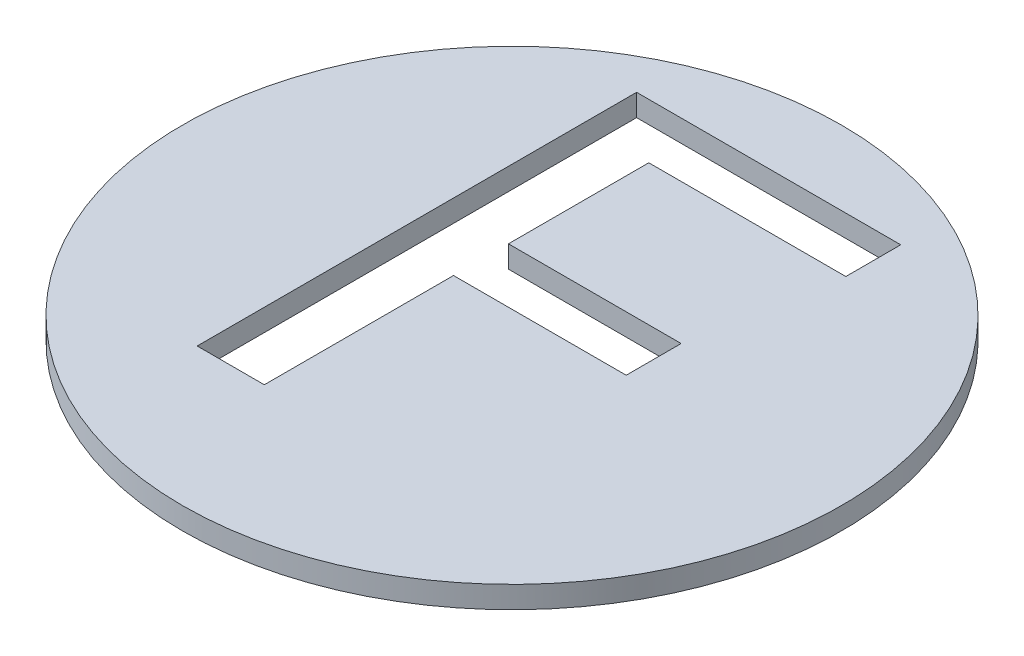
ISO-10303-21;
HEADER;
FILE_DESCRIPTION(('STEP AP214'),'2;1');
FILE_NAME('part.step','',(''),(''),'','','');
FILE_SCHEMA(('AUTOMOTIVE_DESIGN { 1 0 10303 214 1 1 1 1 }'));
ENDSEC;
DATA;
#1=APPLICATION_CONTEXT('core data for automotive mechanical design processes');
#2=APPLICATION_PROTOCOL_DEFINITION('international standard','automotive_design',2000,#1);
#3=PRODUCT_CONTEXT('',#1,'mechanical');
#4=PRODUCT('Part','Part','',(#3));
#5=PRODUCT_RELATED_PRODUCT_CATEGORY('part','',(#4));
#6=PRODUCT_DEFINITION_FORMATION('','',#4);
#7=PRODUCT_DEFINITION_CONTEXT('part definition',#1,'design');
#8=PRODUCT_DEFINITION('design','',#6,#7);
#9=PRODUCT_DEFINITION_SHAPE('','',#8);
#10=(LENGTH_UNIT() NAMED_UNIT(*) SI_UNIT(.MILLI.,.METRE.));
#11=(NAMED_UNIT(*) PLANE_ANGLE_UNIT() SI_UNIT($,.RADIAN.));
#12=(NAMED_UNIT(*) SI_UNIT($,.STERADIAN.) SOLID_ANGLE_UNIT());
#13=UNCERTAINTY_MEASURE_WITH_UNIT(LENGTH_MEASURE(1.E-05),#10,'distance_accuracy_value','');
#14=(GEOMETRIC_REPRESENTATION_CONTEXT(3) GLOBAL_UNCERTAINTY_ASSIGNED_CONTEXT((#13)) GLOBAL_UNIT_ASSIGNED_CONTEXT((#10,
#11,#12)) REPRESENTATION_CONTEXT('',''));
#15=CARTESIAN_POINT('',(0.,0.,0.));
#16=DIRECTION('',(0.,0.,1.));
#17=DIRECTION('',(1.,0.,0.));
#18=AXIS2_PLACEMENT_3D('',#15,#16,#17);
#19=CARTESIAN_POINT('',(0.,3.,0.));
#20=DIRECTION('',(0.,-1.,0.));
#21=DIRECTION('',(0.,0.,-1.));
#22=AXIS2_PLACEMENT_3D('',#19,#20,#21);
#23=CYLINDRICAL_SURFACE('',#22,45.);
#24=CARTESIAN_POINT('',(0.,3.,0.));
#25=DIRECTION('',(0.,1.,0.));
#26=DIRECTION('',(0.,0.,1.));
#27=AXIS2_PLACEMENT_3D('',#24,#25,#26);
#28=CIRCLE('',#27,45.);
#29=CARTESIAN_POINT('',(0.,3.,45.));
#30=VERTEX_POINT('',#29);
#31=EDGE_CURVE('E11',#30,#30,#28,.T.);
#32=ORIENTED_EDGE('',*,*,#31,.F.);
#33=EDGE_LOOP('',(#32));
#34=FACE_BOUND('',#33,.T.);
#35=CARTESIAN_POINT('',(0.,0.,0.));
#36=DIRECTION('',(0.,1.,0.));
#37=DIRECTION('',(0.,0.,1.));
#38=AXIS2_PLACEMENT_3D('',#35,#36,#37);
#39=CIRCLE('',#38,45.);
#40=CARTESIAN_POINT('',(0.,0.,45.));
#41=VERTEX_POINT('',#40);
#42=EDGE_CURVE('E36',#41,#41,#39,.T.);
#43=ORIENTED_EDGE('',*,*,#42,.T.);
#44=EDGE_LOOP('',(#43));
#45=FACE_BOUND('',#44,.T.);
#46=ADVANCED_FACE('F33',(#34,#45),#23,.T.);
#47=CARTESIAN_POINT('',(0.,3.,0.));
#48=DIRECTION('',(0.,1.,0.));
#49=DIRECTION('',(0.,0.,1.));
#50=AXIS2_PLACEMENT_3D('',#47,#48,#49);
#51=PLANE('',#50);
#52=DIRECTION('',(1.,0.,0.));
#53=VECTOR('',#52,1.);
#54=CARTESIAN_POINT('',(-17.8661139991804,3.,-34.8798677033783));
#55=LINE('',#54,#53);
#56=CARTESIAN_POINT('',(-17.8661139991804,3.,-34.8798677033783));
#57=VERTEX_POINT('',#56);
#58=CARTESIAN_POINT('',(18.2015943341529,3.,-34.8798677033783));
#59=VERTEX_POINT('',#58);
#60=EDGE_CURVE('E111',#57,#59,#55,.T.);
#61=ORIENTED_EDGE('',*,*,#60,.T.);
#62=DIRECTION('',(0.,0.,1.));
#63=VECTOR('',#62,1.);
#64=CARTESIAN_POINT('',(18.2015943341529,3.,-34.8798677033783));
#65=LINE('',#64,#63);
#66=CARTESIAN_POINT('',(18.2015943341529,3.,-27.3798677033783));
#67=VERTEX_POINT('',#66);
#68=EDGE_CURVE('E120',#59,#67,#65,.T.);
#69=ORIENTED_EDGE('',*,*,#68,.T.);
#70=DIRECTION('',(-1.,0.,0.));
#71=VECTOR('',#70,1.);
#72=CARTESIAN_POINT('',(18.2015943341529,3.,-27.3798677033783));
#73=LINE('',#72,#71);
#74=CARTESIAN_POINT('',(-8.69944733251376,3.,-27.3798677033783));
#75=VERTEX_POINT('',#74);
#76=EDGE_CURVE('E47',#67,#75,#73,.T.);
#77=ORIENTED_EDGE('',*,*,#76,.T.);
#78=DIRECTION('',(0.,0.,1.));
#79=VECTOR('',#78,1.);
#80=CARTESIAN_POINT('',(-8.69944733251376,3.,-27.3798677033783));
#81=LINE('',#80,#79);
#82=CARTESIAN_POINT('',(-8.69944733251376,3.,-8.21320103671168));
#83=VERTEX_POINT('',#82);
#84=EDGE_CURVE('E135',#75,#83,#81,.T.);
#85=ORIENTED_EDGE('',*,*,#84,.T.);
#86=DIRECTION('',(1.,0.,0.));
#87=VECTOR('',#86,1.);
#88=CARTESIAN_POINT('',(-8.69944733251376,3.,-8.21320103671168));
#89=LINE('',#88,#87);
#90=CARTESIAN_POINT('',(14.8812818341529,3.,-8.21320103671168));
#91=VERTEX_POINT('',#90);
#92=EDGE_CURVE('E138',#83,#91,#89,.T.);
#93=ORIENTED_EDGE('',*,*,#92,.T.);
#94=DIRECTION('',(0.,0.,1.));
#95=VECTOR('',#94,1.);
#96=CARTESIAN_POINT('',(14.8812818341529,3.,-8.21320103671168));
#97=LINE('',#96,#95);
#98=CARTESIAN_POINT('',(14.8812818341529,3.,-0.713201036711679));
#99=VERTEX_POINT('',#98);
#100=EDGE_CURVE('E141',#91,#99,#97,.T.);
#101=ORIENTED_EDGE('',*,*,#100,.T.);
#102=DIRECTION('',(-1.,0.,0.));
#103=VECTOR('',#102,1.);
#104=CARTESIAN_POINT('',(14.8812818341529,3.,-0.713201036711679));
#105=LINE('',#104,#103);
#106=CARTESIAN_POINT('',(-8.69944733251376,3.,-0.713201036711679));
#107=VERTEX_POINT('',#106);
#108=EDGE_CURVE('E144',#99,#107,#105,.T.);
#109=ORIENTED_EDGE('',*,*,#108,.T.);
#110=DIRECTION('',(0.,0.,1.));
#111=VECTOR('',#110,1.);
#112=CARTESIAN_POINT('',(-8.69944733251376,3.,-0.713201036711679));
#113=LINE('',#112,#111);
#114=CARTESIAN_POINT('',(-8.69944733251376,3.,25.1201322966217));
#115=VERTEX_POINT('',#114);
#116=EDGE_CURVE('E147',#107,#115,#113,.T.);
#117=ORIENTED_EDGE('',*,*,#116,.T.);
#118=DIRECTION('',(-1.,0.,0.));
#119=VECTOR('',#118,1.);
#120=CARTESIAN_POINT('',(-8.69944733251376,3.,25.1201322966217));
#121=LINE('',#120,#119);
#122=CARTESIAN_POINT('',(-17.8661139991804,3.,25.1201322966217));
#123=VERTEX_POINT('',#122);
#124=EDGE_CURVE('E150',#115,#123,#121,.T.);
#125=ORIENTED_EDGE('',*,*,#124,.T.);
#126=DIRECTION('',(0.,0.,-1.));
#127=VECTOR('',#126,1.);
#128=CARTESIAN_POINT('',(-17.8661139991804,3.,25.1201322966217));
#129=LINE('',#128,#127);
#130=EDGE_CURVE('E117',#123,#57,#129,.T.);
#131=ORIENTED_EDGE('',*,*,#130,.T.);
#132=EDGE_LOOP('',(#61,#69,#77,#85,#93,#101,#109,#117,#125,#131));
#133=FACE_BOUND('',#132,.T.);
#134=ORIENTED_EDGE('',*,*,#31,.T.);
#135=EDGE_LOOP('',(#134));
#136=FACE_BOUND('',#135,.T.);
#137=ADVANCED_FACE('F124',(#133,#136),#51,.T.);
#138=CARTESIAN_POINT('',(0.,0.,0.));
#139=DIRECTION('',(0.,1.,0.));
#140=DIRECTION('',(0.,0.,1.));
#141=AXIS2_PLACEMENT_3D('',#138,#139,#140);
#142=PLANE('',#141);
#143=DIRECTION('',(0.,0.,1.));
#144=VECTOR('',#143,1.);
#145=CARTESIAN_POINT('',(18.2015943341529,0.,-34.8798677033783));
#146=LINE('',#145,#144);
#147=CARTESIAN_POINT('',(18.2015943341529,0.,-34.8798677033783));
#148=VERTEX_POINT('',#147);
#149=CARTESIAN_POINT('',(18.2015943341529,0.,-27.3798677033783));
#150=VERTEX_POINT('',#149);
#151=EDGE_CURVE('E154',#148,#150,#146,.T.);
#152=ORIENTED_EDGE('',*,*,#151,.F.);
#153=DIRECTION('',(1.,0.,0.));
#154=VECTOR('',#153,1.);
#155=CARTESIAN_POINT('',(-17.8661139991804,0.,-34.8798677033783));
#156=LINE('',#155,#154);
#157=CARTESIAN_POINT('',(-17.8661139991804,0.,-34.8798677033783));
#158=VERTEX_POINT('',#157);
#159=EDGE_CURVE('E55',#158,#148,#156,.T.);
#160=ORIENTED_EDGE('',*,*,#159,.F.);
#161=DIRECTION('',(0.,0.,-1.));
#162=VECTOR('',#161,1.);
#163=CARTESIAN_POINT('',(-17.8661139991804,0.,25.1201322966217));
#164=LINE('',#163,#162);
#165=CARTESIAN_POINT('',(-17.8661139991804,0.,25.1201322966217));
#166=VERTEX_POINT('',#165);
#167=EDGE_CURVE('E128',#166,#158,#164,.T.);
#168=ORIENTED_EDGE('',*,*,#167,.F.);
#169=DIRECTION('',(-1.,0.,0.));
#170=VECTOR('',#169,1.);
#171=CARTESIAN_POINT('',(-8.69944733251376,0.,25.1201322966217));
#172=LINE('',#171,#170);
#173=CARTESIAN_POINT('',(-8.69944733251376,0.,25.1201322966217));
#174=VERTEX_POINT('',#173);
#175=EDGE_CURVE('E131',#174,#166,#172,.T.);
#176=ORIENTED_EDGE('',*,*,#175,.F.);
#177=DIRECTION('',(0.,0.,1.));
#178=VECTOR('',#177,1.);
#179=CARTESIAN_POINT('',(-8.69944733251376,0.,-0.713201036711679));
#180=LINE('',#179,#178);
#181=CARTESIAN_POINT('',(-8.69944733251376,0.,-0.713201036711679));
#182=VERTEX_POINT('',#181);
#183=EDGE_CURVE('E171',#182,#174,#180,.T.);
#184=ORIENTED_EDGE('',*,*,#183,.F.);
#185=DIRECTION('',(-1.,0.,0.));
#186=VECTOR('',#185,1.);
#187=CARTESIAN_POINT('',(14.8812818341529,0.,-0.713201036711679));
#188=LINE('',#187,#186);
#189=CARTESIAN_POINT('',(14.8812818341529,0.,-0.713201036711679));
#190=VERTEX_POINT('',#189);
#191=EDGE_CURVE('E168',#190,#182,#188,.T.);
#192=ORIENTED_EDGE('',*,*,#191,.F.);
#193=DIRECTION('',(0.,0.,1.));
#194=VECTOR('',#193,1.);
#195=CARTESIAN_POINT('',(14.8812818341529,0.,-8.21320103671168));
#196=LINE('',#195,#194);
#197=CARTESIAN_POINT('',(14.8812818341529,0.,-8.21320103671168));
#198=VERTEX_POINT('',#197);
#199=EDGE_CURVE('E165',#198,#190,#196,.T.);
#200=ORIENTED_EDGE('',*,*,#199,.F.);
#201=DIRECTION('',(1.,0.,0.));
#202=VECTOR('',#201,1.);
#203=CARTESIAN_POINT('',(-8.69944733251376,0.,-8.21320103671168));
#204=LINE('',#203,#202);
#205=CARTESIAN_POINT('',(-8.69944733251376,0.,-8.21320103671168));
#206=VERTEX_POINT('',#205);
#207=EDGE_CURVE('E162',#206,#198,#204,.T.);
#208=ORIENTED_EDGE('',*,*,#207,.F.);
#209=DIRECTION('',(0.,0.,1.));
#210=VECTOR('',#209,1.);
#211=CARTESIAN_POINT('',(-8.69944733251376,0.,-27.3798677033783));
#212=LINE('',#211,#210);
#213=CARTESIAN_POINT('',(-8.69944733251376,0.,-27.3798677033783));
#214=VERTEX_POINT('',#213);
#215=EDGE_CURVE('E159',#214,#206,#212,.T.);
#216=ORIENTED_EDGE('',*,*,#215,.F.);
#217=DIRECTION('',(-1.,0.,0.));
#218=VECTOR('',#217,1.);
#219=CARTESIAN_POINT('',(18.2015943341529,0.,-27.3798677033783));
#220=LINE('',#219,#218);
#221=EDGE_CURVE('E156',#150,#214,#220,.T.);
#222=ORIENTED_EDGE('',*,*,#221,.F.);
#223=EDGE_LOOP('',(#152,#160,#168,#176,#184,#192,#200,#208,#216,#222));
#224=FACE_BOUND('',#223,.T.);
#225=ORIENTED_EDGE('',*,*,#42,.F.);
#226=EDGE_LOOP('',(#225));
#227=FACE_BOUND('',#226,.T.);
#228=ADVANCED_FACE('F196',(#224,#227),#142,.F.);
#229=CARTESIAN_POINT('',(-17.8661139991804,3.,-34.8798677033783));
#230=DIRECTION('',(0.,0.,-1.));
#231=DIRECTION('',(-1.,0.,0.));
#232=AXIS2_PLACEMENT_3D('',#229,#230,#231);
#233=PLANE('',#232);
#234=ORIENTED_EDGE('',*,*,#159,.T.);
#235=DIRECTION('',(0.,-1.,0.));
#236=VECTOR('',#235,1.);
#237=CARTESIAN_POINT('',(18.2015943341529,3.,-34.8798677033783));
#238=LINE('',#237,#236);
#239=EDGE_CURVE('E107',#59,#148,#238,.T.);
#240=ORIENTED_EDGE('',*,*,#239,.F.);
#241=ORIENTED_EDGE('',*,*,#60,.F.);
#242=DIRECTION('',(0.,-1.,0.));
#243=VECTOR('',#242,1.);
#244=CARTESIAN_POINT('',(-17.8661139991804,3.,-34.8798677033783));
#245=LINE('',#244,#243);
#246=EDGE_CURVE('E176',#57,#158,#245,.T.);
#247=ORIENTED_EDGE('',*,*,#246,.T.);
#248=EDGE_LOOP('',(#234,#240,#241,#247));
#249=FACE_BOUND('',#248,.T.);
#250=ADVANCED_FACE('F109',(#249),#233,.F.);
#251=CARTESIAN_POINT('',(-17.8661139991804,3.,25.1201322966217));
#252=DIRECTION('',(-1.,0.,0.));
#253=DIRECTION('',(0.,0.,1.));
#254=AXIS2_PLACEMENT_3D('',#251,#252,#253);
#255=PLANE('',#254);
#256=ORIENTED_EDGE('',*,*,#167,.T.);
#257=ORIENTED_EDGE('',*,*,#246,.F.);
#258=ORIENTED_EDGE('',*,*,#130,.F.);
#259=DIRECTION('',(0.,-1.,0.));
#260=VECTOR('',#259,1.);
#261=CARTESIAN_POINT('',(-17.8661139991804,3.,25.1201322966217));
#262=LINE('',#261,#260);
#263=EDGE_CURVE('E178',#123,#166,#262,.T.);
#264=ORIENTED_EDGE('',*,*,#263,.T.);
#265=EDGE_LOOP('',(#256,#257,#258,#264));
#266=FACE_BOUND('',#265,.T.);
#267=ADVANCED_FACE('F223',(#266),#255,.F.);
#268=CARTESIAN_POINT('',(-8.69944733251376,3.,25.1201322966217));
#269=DIRECTION('',(0.,0.,1.));
#270=DIRECTION('',(1.,0.,0.));
#271=AXIS2_PLACEMENT_3D('',#268,#269,#270);
#272=PLANE('',#271);
#273=ORIENTED_EDGE('',*,*,#175,.T.);
#274=ORIENTED_EDGE('',*,*,#263,.F.);
#275=ORIENTED_EDGE('',*,*,#124,.F.);
#276=DIRECTION('',(0.,-1.,0.));
#277=VECTOR('',#276,1.);
#278=CARTESIAN_POINT('',(-8.69944733251376,3.,25.1201322966217));
#279=LINE('',#278,#277);
#280=EDGE_CURVE('E180',#115,#174,#279,.T.);
#281=ORIENTED_EDGE('',*,*,#280,.T.);
#282=EDGE_LOOP('',(#273,#274,#275,#281));
#283=FACE_BOUND('',#282,.T.);
#284=ADVANCED_FACE('F220',(#283),#272,.F.);
#285=CARTESIAN_POINT('',(-8.69944733251376,3.,-0.713201036711679));
#286=DIRECTION('',(1.,0.,0.));
#287=DIRECTION('',(0.,0.,-1.));
#288=AXIS2_PLACEMENT_3D('',#285,#286,#287);
#289=PLANE('',#288);
#290=ORIENTED_EDGE('',*,*,#183,.T.);
#291=ORIENTED_EDGE('',*,*,#280,.F.);
#292=ORIENTED_EDGE('',*,*,#116,.F.);
#293=DIRECTION('',(0.,-1.,0.));
#294=VECTOR('',#293,1.);
#295=CARTESIAN_POINT('',(-8.69944733251376,3.,-0.713201036711679));
#296=LINE('',#295,#294);
#297=EDGE_CURVE('E182',#107,#182,#296,.T.);
#298=ORIENTED_EDGE('',*,*,#297,.T.);
#299=EDGE_LOOP('',(#290,#291,#292,#298));
#300=FACE_BOUND('',#299,.T.);
#301=ADVANCED_FACE('F216',(#300),#289,.F.);
#302=CARTESIAN_POINT('',(14.8812818341529,3.,-0.713201036711679));
#303=DIRECTION('',(0.,0.,1.));
#304=DIRECTION('',(1.,0.,0.));
#305=AXIS2_PLACEMENT_3D('',#302,#303,#304);
#306=PLANE('',#305);
#307=ORIENTED_EDGE('',*,*,#191,.T.);
#308=ORIENTED_EDGE('',*,*,#297,.F.);
#309=ORIENTED_EDGE('',*,*,#108,.F.);
#310=DIRECTION('',(0.,-1.,0.));
#311=VECTOR('',#310,1.);
#312=CARTESIAN_POINT('',(14.8812818341529,3.,-0.713201036711679));
#313=LINE('',#312,#311);
#314=EDGE_CURVE('E184',#99,#190,#313,.T.);
#315=ORIENTED_EDGE('',*,*,#314,.T.);
#316=EDGE_LOOP('',(#307,#308,#309,#315));
#317=FACE_BOUND('',#316,.T.);
#318=ADVANCED_FACE('F212',(#317),#306,.F.);
#319=CARTESIAN_POINT('',(14.8812818341529,3.,-8.21320103671168));
#320=DIRECTION('',(1.,0.,0.));
#321=DIRECTION('',(0.,0.,-1.));
#322=AXIS2_PLACEMENT_3D('',#319,#320,#321);
#323=PLANE('',#322);
#324=ORIENTED_EDGE('',*,*,#199,.T.);
#325=ORIENTED_EDGE('',*,*,#314,.F.);
#326=ORIENTED_EDGE('',*,*,#100,.F.);
#327=DIRECTION('',(0.,-1.,0.));
#328=VECTOR('',#327,1.);
#329=CARTESIAN_POINT('',(14.8812818341529,3.,-8.21320103671168));
#330=LINE('',#329,#328);
#331=EDGE_CURVE('E186',#91,#198,#330,.T.);
#332=ORIENTED_EDGE('',*,*,#331,.T.);
#333=EDGE_LOOP('',(#324,#325,#326,#332));
#334=FACE_BOUND('',#333,.T.);
#335=ADVANCED_FACE('F208',(#334),#323,.F.);
#336=CARTESIAN_POINT('',(-8.69944733251376,3.,-8.21320103671168));
#337=DIRECTION('',(0.,0.,-1.));
#338=DIRECTION('',(-1.,0.,0.));
#339=AXIS2_PLACEMENT_3D('',#336,#337,#338);
#340=PLANE('',#339);
#341=ORIENTED_EDGE('',*,*,#207,.T.);
#342=ORIENTED_EDGE('',*,*,#331,.F.);
#343=ORIENTED_EDGE('',*,*,#92,.F.);
#344=DIRECTION('',(0.,-1.,0.));
#345=VECTOR('',#344,1.);
#346=CARTESIAN_POINT('',(-8.69944733251376,3.,-8.21320103671168));
#347=LINE('',#346,#345);
#348=EDGE_CURVE('E188',#83,#206,#347,.T.);
#349=ORIENTED_EDGE('',*,*,#348,.T.);
#350=EDGE_LOOP('',(#341,#342,#343,#349));
#351=FACE_BOUND('',#350,.T.);
#352=ADVANCED_FACE('F206',(#351),#340,.F.);
#353=CARTESIAN_POINT('',(-8.69944733251376,3.,-27.3798677033783));
#354=DIRECTION('',(1.,0.,0.));
#355=DIRECTION('',(0.,0.,-1.));
#356=AXIS2_PLACEMENT_3D('',#353,#354,#355);
#357=PLANE('',#356);
#358=ORIENTED_EDGE('',*,*,#215,.T.);
#359=ORIENTED_EDGE('',*,*,#348,.F.);
#360=ORIENTED_EDGE('',*,*,#84,.F.);
#361=DIRECTION('',(0.,-1.,0.));
#362=VECTOR('',#361,1.);
#363=CARTESIAN_POINT('',(-8.69944733251376,3.,-27.3798677033783));
#364=LINE('',#363,#362);
#365=EDGE_CURVE('E190',#75,#214,#364,.T.);
#366=ORIENTED_EDGE('',*,*,#365,.T.);
#367=EDGE_LOOP('',(#358,#359,#360,#366));
#368=FACE_BOUND('',#367,.T.);
#369=ADVANCED_FACE('F201',(#368),#357,.F.);
#370=CARTESIAN_POINT('',(18.2015943341529,3.,-27.3798677033783));
#371=DIRECTION('',(0.,0.,1.));
#372=DIRECTION('',(1.,0.,0.));
#373=AXIS2_PLACEMENT_3D('',#370,#371,#372);
#374=PLANE('',#373);
#375=ORIENTED_EDGE('',*,*,#221,.T.);
#376=ORIENTED_EDGE('',*,*,#365,.F.);
#377=ORIENTED_EDGE('',*,*,#76,.F.);
#378=DIRECTION('',(0.,-1.,0.));
#379=VECTOR('',#378,1.);
#380=CARTESIAN_POINT('',(18.2015943341529,3.,-27.3798677033783));
#381=LINE('',#380,#379);
#382=EDGE_CURVE('E116',#67,#150,#381,.T.);
#383=ORIENTED_EDGE('',*,*,#382,.T.);
#384=EDGE_LOOP('',(#375,#376,#377,#383));
#385=FACE_BOUND('',#384,.T.);
#386=ADVANCED_FACE('F192',(#385),#374,.F.);
#387=CARTESIAN_POINT('',(18.2015943341529,3.,-34.8798677033783));
#388=DIRECTION('',(1.,0.,0.));
#389=DIRECTION('',(0.,0.,-1.));
#390=AXIS2_PLACEMENT_3D('',#387,#388,#389);
#391=PLANE('',#390);
#392=ORIENTED_EDGE('',*,*,#151,.T.);
#393=ORIENTED_EDGE('',*,*,#382,.F.);
#394=ORIENTED_EDGE('',*,*,#68,.F.);
#395=ORIENTED_EDGE('',*,*,#239,.T.);
#396=EDGE_LOOP('',(#392,#393,#394,#395));
#397=FACE_BOUND('',#396,.T.);
#398=ADVANCED_FACE('F121',(#397),#391,.F.);
#399=CLOSED_SHELL('',(#46,#137,#228,#250,#267,#284,#301,#318,#335,#352,#369,#386,#398));
#400=MANIFOLD_SOLID_BREP('B2',#399);
#401=ADVANCED_BREP_SHAPE_REPRESENTATION('',(#18,#400),#14);
#402=SHAPE_DEFINITION_REPRESENTATION(#9,#401);
ENDSEC;
END-ISO-10303-21;
